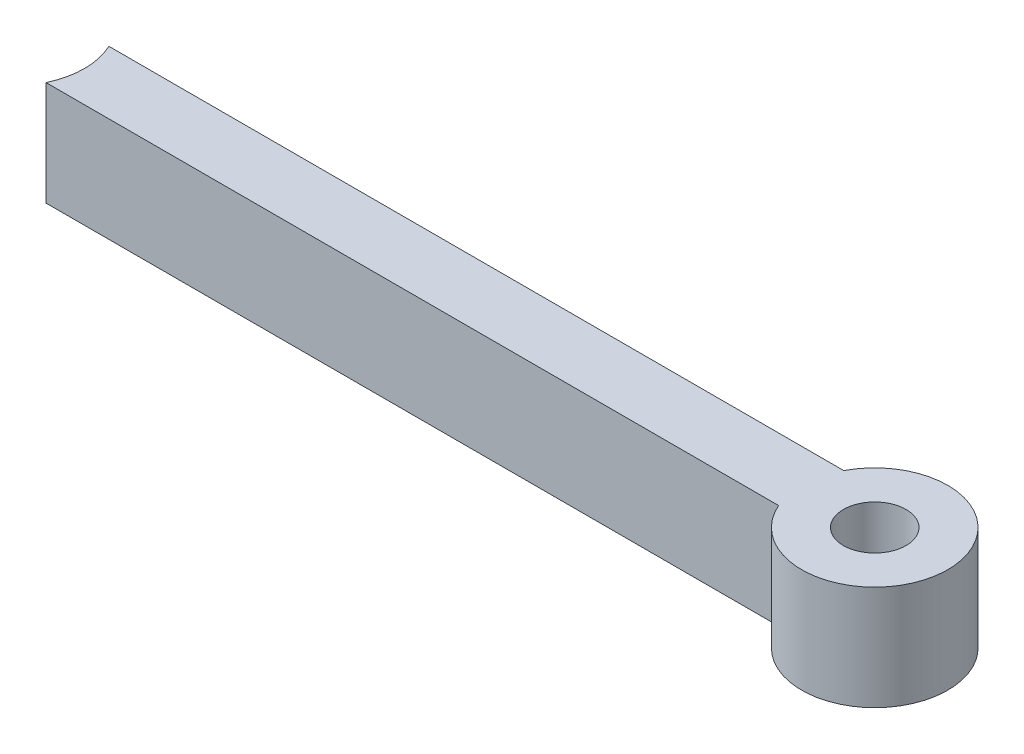
ISO-10303-21;
HEADER;
FILE_DESCRIPTION(('STEP AP214'),'2;1');
FILE_NAME('part.step','',(''),(''),'','','');
FILE_SCHEMA(('AUTOMOTIVE_DESIGN { 1 0 10303 214 1 1 1 1 }'));
ENDSEC;
DATA;
#1=APPLICATION_CONTEXT('core data for automotive mechanical design processes');
#2=APPLICATION_PROTOCOL_DEFINITION('international standard','automotive_design',2000,#1);
#3=PRODUCT_CONTEXT('',#1,'mechanical');
#4=PRODUCT('Part','Part','',(#3));
#5=PRODUCT_RELATED_PRODUCT_CATEGORY('part','',(#4));
#6=PRODUCT_DEFINITION_FORMATION('','',#4);
#7=PRODUCT_DEFINITION_CONTEXT('part definition',#1,'design');
#8=PRODUCT_DEFINITION('design','',#6,#7);
#9=PRODUCT_DEFINITION_SHAPE('','',#8);
#10=(LENGTH_UNIT() NAMED_UNIT(*) SI_UNIT(.MILLI.,.METRE.));
#11=(NAMED_UNIT(*) PLANE_ANGLE_UNIT() SI_UNIT($,.RADIAN.));
#12=(NAMED_UNIT(*) SI_UNIT($,.STERADIAN.) SOLID_ANGLE_UNIT());
#13=UNCERTAINTY_MEASURE_WITH_UNIT(LENGTH_MEASURE(1.E-05),#10,'distance_accuracy_value','');
#14=(GEOMETRIC_REPRESENTATION_CONTEXT(3) GLOBAL_UNCERTAINTY_ASSIGNED_CONTEXT((#13)) GLOBAL_UNIT_ASSIGNED_CONTEXT((#10,
#11,#12)) REPRESENTATION_CONTEXT('',''));
#15=CARTESIAN_POINT('',(0.,0.,0.));
#16=DIRECTION('',(0.,0.,1.));
#17=DIRECTION('',(1.,0.,0.));
#18=AXIS2_PLACEMENT_3D('',#15,#16,#17);
#19=CARTESIAN_POINT('',(0.,100.,30.095541494428));
#20=DIRECTION('',(0.,0.,-1.));
#21=DIRECTION('',(-1.,0.,0.));
#22=AXIS2_PLACEMENT_3D('',#19,#20,#21);
#23=PLANE('',#22);
#24=DIRECTION('',(1.,0.,0.));
#25=VECTOR('',#24,1.);
#26=CARTESIAN_POINT('',(0.,100.,30.095541494428));
#27=LINE('',#26,#25);
#28=CARTESIAN_POINT('',(-324.529611720115,100.,30.095541494428));
#29=VERTEX_POINT('',#28);
#30=CARTESIAN_POINT('',(377.209706533263,100.,30.095541494428));
#31=VERTEX_POINT('',#30);
#32=EDGE_CURVE('E77',#29,#31,#27,.T.);
#33=ORIENTED_EDGE('',*,*,#32,.F.);
#34=DIRECTION('',(0.,1.,0.));
#35=VECTOR('',#34,1.);
#36=CARTESIAN_POINT('',(-324.529611720115,0.,30.095541494428));
#37=LINE('',#36,#35);
#38=CARTESIAN_POINT('',(-324.529611720115,0.,30.095541494428));
#39=VERTEX_POINT('',#38);
#40=EDGE_CURVE('E97',#29,#39,#37,.F.);
#41=ORIENTED_EDGE('',*,*,#40,.T.);
#42=DIRECTION('',(1.,0.,0.));
#43=VECTOR('',#42,1.);
#44=CARTESIAN_POINT('',(0.,0.,30.095541494428));
#45=LINE('',#44,#43);
#46=CARTESIAN_POINT('',(377.209706533263,0.,30.095541494428));
#47=VERTEX_POINT('',#46);
#48=EDGE_CURVE('E85',#39,#47,#45,.T.);
#49=ORIENTED_EDGE('',*,*,#48,.T.);
#50=DIRECTION('',(0.,-1.,0.));
#51=VECTOR('',#50,1.);
#52=CARTESIAN_POINT('',(377.209706533263,100.,30.095541494428));
#53=LINE('',#52,#51);
#54=EDGE_CURVE('E11',#31,#47,#53,.T.);
#55=ORIENTED_EDGE('',*,*,#54,.F.);
#56=EDGE_LOOP('',(#33,#41,#49,#55));
#57=FACE_BOUND('',#56,.T.);
#58=ADVANCED_FACE('F35',(#57),#23,.F.);
#59=CARTESIAN_POINT('',(441.454551790358,100.,2.29986093265718));
#60=DIRECTION('',(0.,-1.,0.));
#61=DIRECTION('',(0.,0.,-1.));
#62=AXIS2_PLACEMENT_3D('',#59,#60,#61);
#63=CYLINDRICAL_SURFACE('',#62,70.);
#64=CARTESIAN_POINT('',(441.454551790358,0.,2.29986093265718));
#65=DIRECTION('',(0.,1.,0.));
#66=DIRECTION('',(0.,0.,1.));
#67=AXIS2_PLACEMENT_3D('',#64,#65,#66);
#68=CIRCLE('',#67,70.);
#69=CARTESIAN_POINT('',(379.401849177279,0.,-30.095541494428));
#70=VERTEX_POINT('',#69);
#71=EDGE_CURVE('E75',#47,#70,#68,.T.);
#72=ORIENTED_EDGE('',*,*,#71,.T.);
#73=DIRECTION('',(0.,-1.,0.));
#74=VECTOR('',#73,1.);
#75=CARTESIAN_POINT('',(379.401849177279,100.,-30.095541494428));
#76=LINE('',#75,#74);
#77=CARTESIAN_POINT('',(379.401849177279,100.,-30.095541494428));
#78=VERTEX_POINT('',#77);
#79=EDGE_CURVE('E42',#78,#70,#76,.T.);
#80=ORIENTED_EDGE('',*,*,#79,.F.);
#81=CARTESIAN_POINT('',(441.454551790358,100.,2.29986093265718));
#82=DIRECTION('',(0.,1.,0.));
#83=DIRECTION('',(0.,0.,1.));
#84=AXIS2_PLACEMENT_3D('',#81,#82,#83);
#85=CIRCLE('',#84,70.);
#86=EDGE_CURVE('E91',#31,#78,#85,.T.);
#87=ORIENTED_EDGE('',*,*,#86,.F.);
#88=ORIENTED_EDGE('',*,*,#54,.T.);
#89=EDGE_LOOP('',(#72,#80,#87,#88));
#90=FACE_BOUND('',#89,.T.);
#91=ADVANCED_FACE('F83',(#90),#63,.T.);
#92=CARTESIAN_POINT('',(0.,100.,-30.095541494428));
#93=DIRECTION('',(0.,0.,-1.));
#94=DIRECTION('',(-1.,0.,0.));
#95=AXIS2_PLACEMENT_3D('',#92,#93,#94);
#96=PLANE('',#95);
#97=DIRECTION('',(0.,1.,0.));
#98=VECTOR('',#97,1.);
#99=CARTESIAN_POINT('',(-324.529611720115,0.,-30.095541494428));
#100=LINE('',#99,#98);
#101=CARTESIAN_POINT('',(-324.529611720115,100.,-30.095541494428));
#102=VERTEX_POINT('',#101);
#103=CARTESIAN_POINT('',(-324.529611720115,0.,-30.095541494428));
#104=VERTEX_POINT('',#103);
#105=EDGE_CURVE('E49',#102,#104,#100,.F.);
#106=ORIENTED_EDGE('',*,*,#105,.F.);
#107=DIRECTION('',(1.,0.,0.));
#108=VECTOR('',#107,1.);
#109=CARTESIAN_POINT('',(0.,100.,-30.095541494428));
#110=LINE('',#109,#108);
#111=EDGE_CURVE('E57',#102,#78,#110,.T.);
#112=ORIENTED_EDGE('',*,*,#111,.T.);
#113=ORIENTED_EDGE('',*,*,#79,.T.);
#114=DIRECTION('',(1.,0.,0.));
#115=VECTOR('',#114,1.);
#116=CARTESIAN_POINT('',(0.,0.,-30.095541494428));
#117=LINE('',#116,#115);
#118=EDGE_CURVE('E71',#104,#70,#117,.T.);
#119=ORIENTED_EDGE('',*,*,#118,.F.);
#120=EDGE_LOOP('',(#106,#112,#113,#119));
#121=FACE_BOUND('',#120,.T.);
#122=ADVANCED_FACE('F80',(#121),#96,.T.);
#123=CARTESIAN_POINT('',(0.,100.,0.));
#124=DIRECTION('',(0.,1.,0.));
#125=DIRECTION('',(0.,0.,1.));
#126=AXIS2_PLACEMENT_3D('',#123,#124,#125);
#127=PLANE('',#126);
#128=CARTESIAN_POINT('',(-387.729757148406,100.,0.));
#129=DIRECTION('',(0.,1.,0.));
#130=DIRECTION('',(0.,0.,1.));
#131=AXIS2_PLACEMENT_3D('',#128,#129,#130);
#132=CIRCLE('',#131,70.);
#133=EDGE_CURVE('E103',#29,#102,#132,.T.);
#134=ORIENTED_EDGE('',*,*,#133,.F.);
#135=ORIENTED_EDGE('',*,*,#32,.T.);
#136=ORIENTED_EDGE('',*,*,#86,.T.);
#137=ORIENTED_EDGE('',*,*,#111,.F.);
#138=EDGE_LOOP('',(#134,#135,#136,#137));
#139=FACE_BOUND('',#138,.T.);
#140=CARTESIAN_POINT('',(441.454551790358,100.,2.29986093265718));
#141=DIRECTION('',(0.,1.,0.));
#142=DIRECTION('',(0.,0.,1.));
#143=AXIS2_PLACEMENT_3D('',#140,#141,#142);
#144=CIRCLE('',#143,30.);
#145=CARTESIAN_POINT('',(441.454551790358,100.,32.2998609326572));
#146=VERTEX_POINT('',#145);
#147=EDGE_CURVE('E94',#146,#146,#144,.T.);
#148=ORIENTED_EDGE('',*,*,#147,.F.);
#149=EDGE_LOOP('',(#148));
#150=FACE_BOUND('',#149,.T.);
#151=ADVANCED_FACE('F111',(#139,#150),#127,.T.);
#152=CARTESIAN_POINT('',(0.,0.,0.));
#153=DIRECTION('',(0.,1.,0.));
#154=DIRECTION('',(0.,0.,1.));
#155=AXIS2_PLACEMENT_3D('',#152,#153,#154);
#156=PLANE('',#155);
#157=CARTESIAN_POINT('',(441.454551790358,0.,2.29986093265718));
#158=DIRECTION('',(0.,1.,0.));
#159=DIRECTION('',(0.,0.,1.));
#160=AXIS2_PLACEMENT_3D('',#157,#158,#159);
#161=CIRCLE('',#160,30.);
#162=CARTESIAN_POINT('',(441.454551790358,0.,32.2998609326572));
#163=VERTEX_POINT('',#162);
#164=EDGE_CURVE('E87',#163,#163,#161,.T.);
#165=ORIENTED_EDGE('',*,*,#164,.T.);
#166=EDGE_LOOP('',(#165));
#167=FACE_BOUND('',#166,.T.);
#168=ORIENTED_EDGE('',*,*,#48,.F.);
#169=CARTESIAN_POINT('',(-387.729757148406,0.,0.));
#170=DIRECTION('',(0.,1.,0.));
#171=DIRECTION('',(0.,0.,1.));
#172=AXIS2_PLACEMENT_3D('',#169,#170,#171);
#173=CIRCLE('',#172,70.);
#174=EDGE_CURVE('E76',#39,#104,#173,.T.);
#175=ORIENTED_EDGE('',*,*,#174,.T.);
#176=ORIENTED_EDGE('',*,*,#118,.T.);
#177=ORIENTED_EDGE('',*,*,#71,.F.);
#178=EDGE_LOOP('',(#168,#175,#176,#177));
#179=FACE_BOUND('',#178,.T.);
#180=ADVANCED_FACE('F73',(#167,#179),#156,.F.);
#181=CARTESIAN_POINT('',(441.454551790358,0.,2.29986093265718));
#182=DIRECTION('',(0.,1.,0.));
#183=DIRECTION('',(0.,0.,1.));
#184=AXIS2_PLACEMENT_3D('',#181,#182,#183);
#185=CYLINDRICAL_SURFACE('',#184,30.);
#186=ORIENTED_EDGE('',*,*,#164,.F.);
#187=EDGE_LOOP('',(#186));
#188=FACE_BOUND('',#187,.T.);
#189=ORIENTED_EDGE('',*,*,#147,.T.);
#190=EDGE_LOOP('',(#189));
#191=FACE_BOUND('',#190,.T.);
#192=ADVANCED_FACE('F128',(#188,#191),#185,.F.);
#193=CARTESIAN_POINT('',(-387.729757148406,0.,0.));
#194=DIRECTION('',(0.,1.,0.));
#195=DIRECTION('',(0.,0.,1.));
#196=AXIS2_PLACEMENT_3D('',#193,#194,#195);
#197=CYLINDRICAL_SURFACE('',#196,70.);
#198=ORIENTED_EDGE('',*,*,#133,.T.);
#199=ORIENTED_EDGE('',*,*,#105,.T.);
#200=ORIENTED_EDGE('',*,*,#174,.F.);
#201=ORIENTED_EDGE('',*,*,#40,.F.);
#202=EDGE_LOOP('',(#198,#199,#200,#201));
#203=FACE_BOUND('',#202,.T.);
#204=ADVANCED_FACE('F107',(#203),#197,.F.);
#205=CLOSED_SHELL('',(#58,#91,#122,#151,#180,#192,#204));
#206=MANIFOLD_SOLID_BREP('B2',#205);
#207=ADVANCED_BREP_SHAPE_REPRESENTATION('',(#18,#206),#14);
#208=SHAPE_DEFINITION_REPRESENTATION(#9,#207);
ENDSEC;
END-ISO-10303-21;
